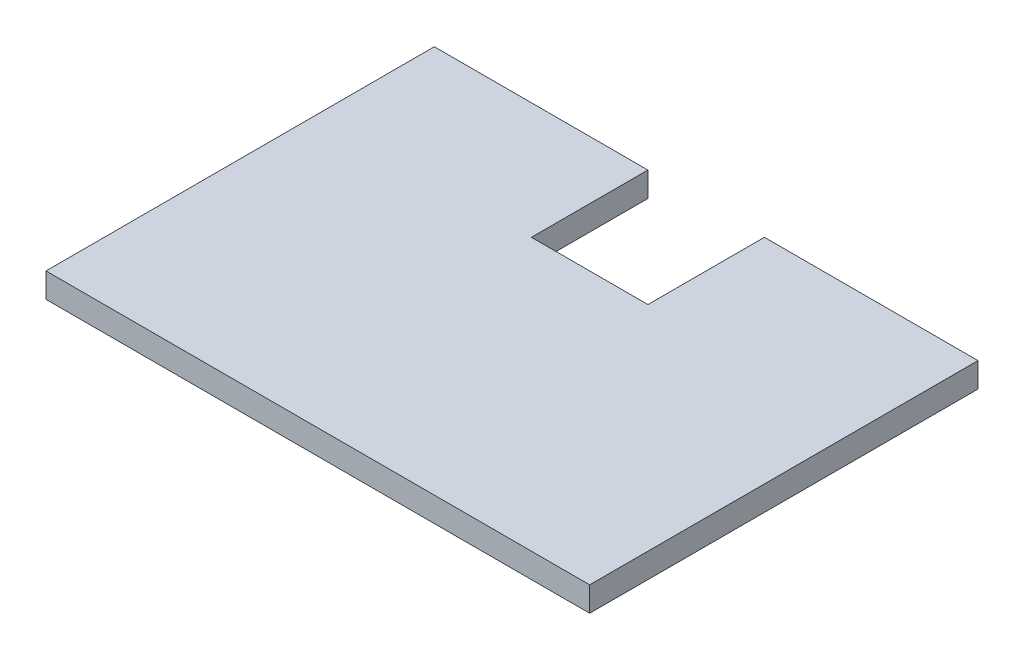
ISO-10303-21;
HEADER;
FILE_DESCRIPTION(('STEP AP214'),'2;1');
FILE_NAME('part.step','',(''),(''),'','','');
FILE_SCHEMA(('AUTOMOTIVE_DESIGN { 1 0 10303 214 1 1 1 1 }'));
ENDSEC;
DATA;
#1=APPLICATION_CONTEXT('core data for automotive mechanical design processes');
#2=APPLICATION_PROTOCOL_DEFINITION('international standard','automotive_design',2000,#1);
#3=PRODUCT_CONTEXT('',#1,'mechanical');
#4=PRODUCT('Part','Part','',(#3));
#5=PRODUCT_RELATED_PRODUCT_CATEGORY('part','',(#4));
#6=PRODUCT_DEFINITION_FORMATION('','',#4);
#7=PRODUCT_DEFINITION_CONTEXT('part definition',#1,'design');
#8=PRODUCT_DEFINITION('design','',#6,#7);
#9=PRODUCT_DEFINITION_SHAPE('','',#8);
#10=(LENGTH_UNIT() NAMED_UNIT(*) SI_UNIT(.MILLI.,.METRE.));
#11=(NAMED_UNIT(*) PLANE_ANGLE_UNIT() SI_UNIT($,.RADIAN.));
#12=(NAMED_UNIT(*) SI_UNIT($,.STERADIAN.) SOLID_ANGLE_UNIT());
#13=UNCERTAINTY_MEASURE_WITH_UNIT(LENGTH_MEASURE(1.E-05),#10,'distance_accuracy_value','');
#14=(GEOMETRIC_REPRESENTATION_CONTEXT(3) GLOBAL_UNCERTAINTY_ASSIGNED_CONTEXT((#13)) GLOBAL_UNIT_ASSIGNED_CONTEXT((#10,
#11,#12)) REPRESENTATION_CONTEXT('',''));
#15=CARTESIAN_POINT('',(0.,0.,0.));
#16=DIRECTION('',(0.,0.,1.));
#17=DIRECTION('',(1.,0.,0.));
#18=AXIS2_PLACEMENT_3D('',#15,#16,#17);
#19=CARTESIAN_POINT('',(-35.,3.175,-25.));
#20=DIRECTION('',(0.,0.,1.));
#21=DIRECTION('',(1.,0.,0.));
#22=AXIS2_PLACEMENT_3D('',#19,#20,#21);
#23=PLANE('',#22);
#24=DIRECTION('',(-1.,0.,0.));
#25=VECTOR('',#24,1.);
#26=CARTESIAN_POINT('',(-35.,3.175,-25.));
#27=LINE('',#26,#25);
#28=CARTESIAN_POINT('',(-7.49999999999999,3.175,-25.));
#29=VERTEX_POINT('',#28);
#30=CARTESIAN_POINT('',(-35.,3.175,-25.));
#31=VERTEX_POINT('',#30);
#32=EDGE_CURVE('E145',#29,#31,#27,.T.);
#33=ORIENTED_EDGE('',*,*,#32,.F.);
#34=DIRECTION('',(0.,1.,0.));
#35=VECTOR('',#34,1.);
#36=CARTESIAN_POINT('',(-7.49999999999999,0.,-25.));
#37=LINE('',#36,#35);
#38=CARTESIAN_POINT('',(-7.49999999999999,0.,-25.));
#39=VERTEX_POINT('',#38);
#40=EDGE_CURVE('E137',#39,#29,#37,.T.);
#41=ORIENTED_EDGE('',*,*,#40,.F.);
#42=DIRECTION('',(-1.,0.,0.));
#43=VECTOR('',#42,1.);
#44=CARTESIAN_POINT('',(-35.,0.,-25.));
#45=LINE('',#44,#43);
#46=CARTESIAN_POINT('',(-35.,0.,-25.));
#47=VERTEX_POINT('',#46);
#48=EDGE_CURVE('E128',#39,#47,#45,.T.);
#49=ORIENTED_EDGE('',*,*,#48,.T.);
#50=DIRECTION('',(0.,-1.,0.));
#51=VECTOR('',#50,1.);
#52=CARTESIAN_POINT('',(-35.,3.175,-25.));
#53=LINE('',#52,#51);
#54=EDGE_CURVE('E41',#31,#47,#53,.T.);
#55=ORIENTED_EDGE('',*,*,#54,.F.);
#56=EDGE_LOOP('',(#33,#41,#49,#55));
#57=FACE_BOUND('',#56,.T.);
#58=ADVANCED_FACE('F33',(#57),#23,.F.);
#59=CARTESIAN_POINT('',(35.,3.175,-25.));
#60=DIRECTION('',(-1.,0.,0.));
#61=DIRECTION('',(0.,0.,1.));
#62=AXIS2_PLACEMENT_3D('',#59,#60,#61);
#63=PLANE('',#62);
#64=DIRECTION('',(0.,0.,-1.));
#65=VECTOR('',#64,1.);
#66=CARTESIAN_POINT('',(35.,0.,-25.));
#67=LINE('',#66,#65);
#68=CARTESIAN_POINT('',(35.,0.,25.));
#69=VERTEX_POINT('',#68);
#70=CARTESIAN_POINT('',(35.,0.,-25.));
#71=VERTEX_POINT('',#70);
#72=EDGE_CURVE('E139',#69,#71,#67,.T.);
#73=ORIENTED_EDGE('',*,*,#72,.T.);
#74=DIRECTION('',(0.,-1.,0.));
#75=VECTOR('',#74,1.);
#76=CARTESIAN_POINT('',(35.,3.175,-25.));
#77=LINE('',#76,#75);
#78=CARTESIAN_POINT('',(35.,3.175,-25.));
#79=VERTEX_POINT('',#78);
#80=EDGE_CURVE('E11',#79,#71,#77,.T.);
#81=ORIENTED_EDGE('',*,*,#80,.F.);
#82=DIRECTION('',(0.,0.,-1.));
#83=VECTOR('',#82,1.);
#84=CARTESIAN_POINT('',(35.,3.175,-25.));
#85=LINE('',#84,#83);
#86=CARTESIAN_POINT('',(35.,3.175,25.));
#87=VERTEX_POINT('',#86);
#88=EDGE_CURVE('E143',#87,#79,#85,.T.);
#89=ORIENTED_EDGE('',*,*,#88,.F.);
#90=DIRECTION('',(0.,-1.,0.));
#91=VECTOR('',#90,1.);
#92=CARTESIAN_POINT('',(35.,3.175,25.));
#93=LINE('',#92,#91);
#94=EDGE_CURVE('E150',#87,#69,#93,.T.);
#95=ORIENTED_EDGE('',*,*,#94,.T.);
#96=EDGE_LOOP('',(#73,#81,#89,#95));
#97=FACE_BOUND('',#96,.T.);
#98=ADVANCED_FACE('F35',(#97),#63,.F.);
#99=CARTESIAN_POINT('',(7.5,0.,-25.));
#100=VERTEX_POINT('',#99);
#101=EDGE_CURVE('E153',#71,#100,#45,.T.);
#102=ORIENTED_EDGE('',*,*,#101,.T.);
#103=DIRECTION('',(0.,1.,0.));
#104=VECTOR('',#103,1.);
#105=CARTESIAN_POINT('',(7.5,0.,-25.));
#106=LINE('',#105,#104);
#107=CARTESIAN_POINT('',(7.5,3.175,-25.));
#108=VERTEX_POINT('',#107);
#109=EDGE_CURVE('E140',#100,#108,#106,.T.);
#110=ORIENTED_EDGE('',*,*,#109,.T.);
#111=EDGE_CURVE('E85',#79,#108,#27,.T.);
#112=ORIENTED_EDGE('',*,*,#111,.F.);
#113=ORIENTED_EDGE('',*,*,#80,.T.);
#114=EDGE_LOOP('',(#102,#110,#112,#113));
#115=FACE_BOUND('',#114,.T.);
#116=ADVANCED_FACE('F182',(#115),#23,.F.);
#117=CARTESIAN_POINT('',(-35.,3.175,-25.));
#118=DIRECTION('',(1.,0.,0.));
#119=DIRECTION('',(0.,0.,-1.));
#120=AXIS2_PLACEMENT_3D('',#117,#118,#119);
#121=PLANE('',#120);
#122=DIRECTION('',(0.,0.,1.));
#123=VECTOR('',#122,1.);
#124=CARTESIAN_POINT('',(-35.,0.,-25.));
#125=LINE('',#124,#123);
#126=CARTESIAN_POINT('',(-35.,0.,25.));
#127=VERTEX_POINT('',#126);
#128=EDGE_CURVE('E156',#47,#127,#125,.T.);
#129=ORIENTED_EDGE('',*,*,#128,.T.);
#130=DIRECTION('',(0.,-1.,0.));
#131=VECTOR('',#130,1.);
#132=CARTESIAN_POINT('',(-35.,3.175,25.));
#133=LINE('',#132,#131);
#134=CARTESIAN_POINT('',(-35.,3.175,25.));
#135=VERTEX_POINT('',#134);
#136=EDGE_CURVE('E160',#135,#127,#133,.T.);
#137=ORIENTED_EDGE('',*,*,#136,.F.);
#138=DIRECTION('',(0.,0.,1.));
#139=VECTOR('',#138,1.);
#140=CARTESIAN_POINT('',(-35.,3.175,-25.));
#141=LINE('',#140,#139);
#142=EDGE_CURVE('E147',#31,#135,#141,.T.);
#143=ORIENTED_EDGE('',*,*,#142,.F.);
#144=ORIENTED_EDGE('',*,*,#54,.T.);
#145=EDGE_LOOP('',(#129,#137,#143,#144));
#146=FACE_BOUND('',#145,.T.);
#147=ADVANCED_FACE('F165',(#146),#121,.F.);
#148=CARTESIAN_POINT('',(-35.,3.175,25.));
#149=DIRECTION('',(0.,0.,-1.));
#150=DIRECTION('',(-1.,0.,0.));
#151=AXIS2_PLACEMENT_3D('',#148,#149,#150);
#152=PLANE('',#151);
#153=DIRECTION('',(1.,0.,0.));
#154=VECTOR('',#153,1.);
#155=CARTESIAN_POINT('',(-35.,0.,25.));
#156=LINE('',#155,#154);
#157=EDGE_CURVE('E78',#127,#69,#156,.T.);
#158=ORIENTED_EDGE('',*,*,#157,.T.);
#159=ORIENTED_EDGE('',*,*,#94,.F.);
#160=DIRECTION('',(1.,0.,0.));
#161=VECTOR('',#160,1.);
#162=CARTESIAN_POINT('',(-35.,3.175,25.));
#163=LINE('',#162,#161);
#164=EDGE_CURVE('E57',#135,#87,#163,.T.);
#165=ORIENTED_EDGE('',*,*,#164,.F.);
#166=ORIENTED_EDGE('',*,*,#136,.T.);
#167=EDGE_LOOP('',(#158,#159,#165,#166));
#168=FACE_BOUND('',#167,.T.);
#169=ADVANCED_FACE('F173',(#168),#152,.F.);
#170=CARTESIAN_POINT('',(0.,3.175,0.));
#171=DIRECTION('',(0.,1.,0.));
#172=DIRECTION('',(0.,0.,1.));
#173=AXIS2_PLACEMENT_3D('',#170,#171,#172);
#174=PLANE('',#173);
#175=DIRECTION('',(0.,0.,1.));
#176=VECTOR('',#175,1.);
#177=CARTESIAN_POINT('',(-7.49999999999999,3.175,-25.));
#178=LINE('',#177,#176);
#179=CARTESIAN_POINT('',(-7.5,3.175,-10.));
#180=VERTEX_POINT('',#179);
#181=EDGE_CURVE('E114',#29,#180,#178,.T.);
#182=ORIENTED_EDGE('',*,*,#181,.F.);
#183=ORIENTED_EDGE('',*,*,#32,.T.);
#184=ORIENTED_EDGE('',*,*,#142,.T.);
#185=ORIENTED_EDGE('',*,*,#164,.T.);
#186=ORIENTED_EDGE('',*,*,#88,.T.);
#187=ORIENTED_EDGE('',*,*,#111,.T.);
#188=DIRECTION('',(0.,0.,-1.));
#189=VECTOR('',#188,1.);
#190=CARTESIAN_POINT('',(7.5,3.175,-25.));
#191=LINE('',#190,#189);
#192=CARTESIAN_POINT('',(7.5,3.175,-10.));
#193=VERTEX_POINT('',#192);
#194=EDGE_CURVE('E129',#193,#108,#191,.T.);
#195=ORIENTED_EDGE('',*,*,#194,.F.);
#196=DIRECTION('',(1.,0.,0.));
#197=VECTOR('',#196,1.);
#198=CARTESIAN_POINT('',(-7.5,3.175,-10.));
#199=LINE('',#198,#197);
#200=EDGE_CURVE('E131',#180,#193,#199,.T.);
#201=ORIENTED_EDGE('',*,*,#200,.F.);
#202=EDGE_LOOP('',(#182,#183,#184,#185,#186,#187,#195,#201));
#203=FACE_BOUND('',#202,.T.);
#204=ADVANCED_FACE('F175',(#203),#174,.T.);
#205=CARTESIAN_POINT('',(0.,0.,0.));
#206=DIRECTION('',(0.,1.,0.));
#207=DIRECTION('',(0.,0.,1.));
#208=AXIS2_PLACEMENT_3D('',#205,#206,#207);
#209=PLANE('',#208);
#210=ORIENTED_EDGE('',*,*,#48,.F.);
#211=DIRECTION('',(0.,0.,1.));
#212=VECTOR('',#211,1.);
#213=CARTESIAN_POINT('',(-7.49999999999999,0.,-25.));
#214=LINE('',#213,#212);
#215=CARTESIAN_POINT('',(-7.5,0.,-10.));
#216=VERTEX_POINT('',#215);
#217=EDGE_CURVE('E111',#39,#216,#214,.T.);
#218=ORIENTED_EDGE('',*,*,#217,.T.);
#219=DIRECTION('',(1.,0.,0.));
#220=VECTOR('',#219,1.);
#221=CARTESIAN_POINT('',(-7.5,0.,-10.));
#222=LINE('',#221,#220);
#223=CARTESIAN_POINT('',(7.5,0.,-10.));
#224=VERTEX_POINT('',#223);
#225=EDGE_CURVE('E121',#216,#224,#222,.T.);
#226=ORIENTED_EDGE('',*,*,#225,.T.);
#227=DIRECTION('',(0.,0.,-1.));
#228=VECTOR('',#227,1.);
#229=CARTESIAN_POINT('',(7.5,0.,-25.));
#230=LINE('',#229,#228);
#231=EDGE_CURVE('E48',#224,#100,#230,.T.);
#232=ORIENTED_EDGE('',*,*,#231,.T.);
#233=ORIENTED_EDGE('',*,*,#101,.F.);
#234=ORIENTED_EDGE('',*,*,#72,.F.);
#235=ORIENTED_EDGE('',*,*,#157,.F.);
#236=ORIENTED_EDGE('',*,*,#128,.F.);
#237=EDGE_LOOP('',(#210,#218,#226,#232,#233,#234,#235,#236));
#238=FACE_BOUND('',#237,.T.);
#239=ADVANCED_FACE('F126',(#238),#209,.F.);
#240=CARTESIAN_POINT('',(-7.49999999999999,0.,-25.));
#241=DIRECTION('',(-1.,0.,0.));
#242=DIRECTION('',(0.,0.,1.));
#243=AXIS2_PLACEMENT_3D('',#240,#241,#242);
#244=PLANE('',#243);
#245=ORIENTED_EDGE('',*,*,#181,.T.);
#246=DIRECTION('',(0.,1.,0.));
#247=VECTOR('',#246,1.);
#248=CARTESIAN_POINT('',(-7.5,0.,-10.));
#249=LINE('',#248,#247);
#250=EDGE_CURVE('E107',#216,#180,#249,.T.);
#251=ORIENTED_EDGE('',*,*,#250,.F.);
#252=ORIENTED_EDGE('',*,*,#217,.F.);
#253=ORIENTED_EDGE('',*,*,#40,.T.);
#254=EDGE_LOOP('',(#245,#251,#252,#253));
#255=FACE_BOUND('',#254,.T.);
#256=ADVANCED_FACE('F109',(#255),#244,.F.);
#257=CARTESIAN_POINT('',(7.5,0.,-25.));
#258=DIRECTION('',(1.,0.,0.));
#259=DIRECTION('',(0.,0.,-1.));
#260=AXIS2_PLACEMENT_3D('',#257,#258,#259);
#261=PLANE('',#260);
#262=ORIENTED_EDGE('',*,*,#194,.T.);
#263=ORIENTED_EDGE('',*,*,#109,.F.);
#264=ORIENTED_EDGE('',*,*,#231,.F.);
#265=DIRECTION('',(0.,1.,0.));
#266=VECTOR('',#265,1.);
#267=CARTESIAN_POINT('',(7.5,0.,-10.));
#268=LINE('',#267,#266);
#269=EDGE_CURVE('E118',#224,#193,#268,.T.);
#270=ORIENTED_EDGE('',*,*,#269,.T.);
#271=EDGE_LOOP('',(#262,#263,#264,#270));
#272=FACE_BOUND('',#271,.T.);
#273=ADVANCED_FACE('F193',(#272),#261,.F.);
#274=CARTESIAN_POINT('',(-7.5,0.,-10.));
#275=DIRECTION('',(0.,0.,1.));
#276=DIRECTION('',(1.,0.,0.));
#277=AXIS2_PLACEMENT_3D('',#274,#275,#276);
#278=PLANE('',#277);
#279=ORIENTED_EDGE('',*,*,#200,.T.);
#280=ORIENTED_EDGE('',*,*,#269,.F.);
#281=ORIENTED_EDGE('',*,*,#225,.F.);
#282=ORIENTED_EDGE('',*,*,#250,.T.);
#283=EDGE_LOOP('',(#279,#280,#281,#282));
#284=FACE_BOUND('',#283,.T.);
#285=ADVANCED_FACE('F122',(#284),#278,.F.);
#286=CLOSED_SHELL('',(#58,#98,#116,#147,#169,#204,#239,#256,#273,#285));
#287=MANIFOLD_SOLID_BREP('B2',#286);
#288=ADVANCED_BREP_SHAPE_REPRESENTATION('',(#18,#287),#14);
#289=SHAPE_DEFINITION_REPRESENTATION(#9,#288);
ENDSEC;
END-ISO-10303-21;
